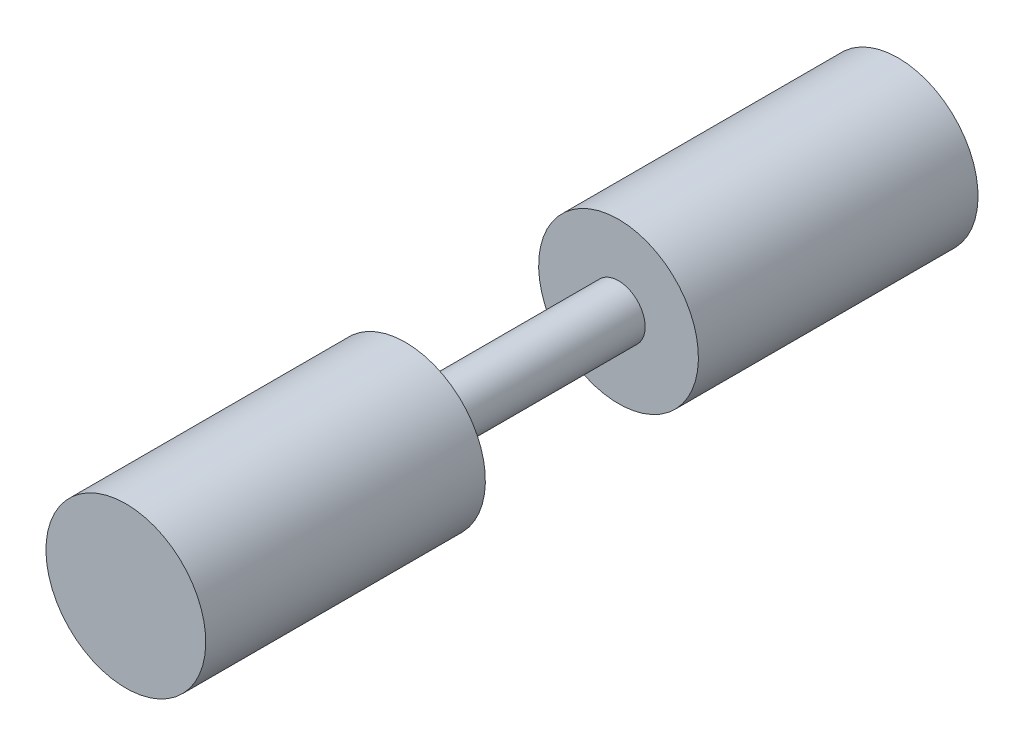
ISO-10303-21;
HEADER;
FILE_DESCRIPTION(('STEP AP214'),'2;1');
FILE_NAME('part.step','',(''),(''),'','','');
FILE_SCHEMA(('AUTOMOTIVE_DESIGN { 1 0 10303 214 1 1 1 1 }'));
ENDSEC;
DATA;
#1=APPLICATION_CONTEXT('core data for automotive mechanical design processes');
#2=APPLICATION_PROTOCOL_DEFINITION('international standard','automotive_design',2000,#1);
#3=PRODUCT_CONTEXT('',#1,'mechanical');
#4=PRODUCT('Part','Part','',(#3));
#5=PRODUCT_RELATED_PRODUCT_CATEGORY('part','',(#4));
#6=PRODUCT_DEFINITION_FORMATION('','',#4);
#7=PRODUCT_DEFINITION_CONTEXT('part definition',#1,'design');
#8=PRODUCT_DEFINITION('design','',#6,#7);
#9=PRODUCT_DEFINITION_SHAPE('','',#8);
#10=(LENGTH_UNIT() NAMED_UNIT(*) SI_UNIT(.MILLI.,.METRE.));
#11=(NAMED_UNIT(*) PLANE_ANGLE_UNIT() SI_UNIT($,.RADIAN.));
#12=(NAMED_UNIT(*) SI_UNIT($,.STERADIAN.) SOLID_ANGLE_UNIT());
#13=UNCERTAINTY_MEASURE_WITH_UNIT(LENGTH_MEASURE(1.E-05),#10,'distance_accuracy_value','');
#14=(GEOMETRIC_REPRESENTATION_CONTEXT(3) GLOBAL_UNCERTAINTY_ASSIGNED_CONTEXT((#13)) GLOBAL_UNIT_ASSIGNED_CONTEXT((#10,
#11,#12)) REPRESENTATION_CONTEXT('',''));
#15=CARTESIAN_POINT('',(0.,0.,0.));
#16=DIRECTION('',(0.,0.,1.));
#17=DIRECTION('',(1.,0.,0.));
#18=AXIS2_PLACEMENT_3D('',#15,#16,#17);
#19=CARTESIAN_POINT('',(0.,0.,-92.075));
#20=DIRECTION('',(0.,0.,-1.));
#21=DIRECTION('',(0.,1.,0.));
#22=AXIS2_PLACEMENT_3D('',#19,#20,#21);
#23=CYLINDRICAL_SURFACE('',#22,19.05);
#24=CARTESIAN_POINT('',(0.,0.,-25.4));
#25=DIRECTION('',(0.,0.,-1.));
#26=DIRECTION('',(0.,1.,0.));
#27=AXIS2_PLACEMENT_3D('',#24,#25,#26);
#28=CIRCLE('',#27,19.05);
#29=CARTESIAN_POINT('',(0.,19.05,-25.4));
#30=VERTEX_POINT('',#29);
#31=EDGE_CURVE('E52',#30,#30,#28,.T.);
#32=ORIENTED_EDGE('',*,*,#31,.T.);
#33=EDGE_LOOP('',(#32));
#34=FACE_BOUND('',#33,.T.);
#35=CARTESIAN_POINT('',(0.,0.,-92.075));
#36=DIRECTION('',(0.,0.,-1.));
#37=DIRECTION('',(0.,1.,0.));
#38=AXIS2_PLACEMENT_3D('',#35,#36,#37);
#39=CIRCLE('',#38,19.05);
#40=CARTESIAN_POINT('',(0.,19.05,-92.075));
#41=VERTEX_POINT('',#40);
#42=EDGE_CURVE('E10',#41,#41,#39,.T.);
#43=ORIENTED_EDGE('',*,*,#42,.F.);
#44=EDGE_LOOP('',(#43));
#45=FACE_BOUND('',#44,.T.);
#46=ADVANCED_FACE('F30',(#34,#45),#23,.T.);
#47=CARTESIAN_POINT('',(0.,19.05,-92.075));
#48=DIRECTION('',(0.,0.,-1.));
#49=DIRECTION('',(0.,1.,0.));
#50=AXIS2_PLACEMENT_3D('',#47,#48,#49);
#51=PLANE('',#50);
#52=ORIENTED_EDGE('',*,*,#42,.T.);
#53=EDGE_LOOP('',(#52));
#54=FACE_BOUND('',#53,.T.);
#55=ADVANCED_FACE('F70',(#54),#51,.T.);
#56=CARTESIAN_POINT('',(0.,0.,92.075));
#57=DIRECTION('',(0.,0.,1.));
#58=DIRECTION('',(0.,-1.,0.));
#59=AXIS2_PLACEMENT_3D('',#56,#57,#58);
#60=PLANE('',#59);
#61=CARTESIAN_POINT('',(0.,0.,92.075));
#62=DIRECTION('',(0.,0.,-1.));
#63=DIRECTION('',(0.,1.,0.));
#64=AXIS2_PLACEMENT_3D('',#61,#62,#63);
#65=CIRCLE('',#64,19.05);
#66=CARTESIAN_POINT('',(0.,19.05,92.075));
#67=VERTEX_POINT('',#66);
#68=EDGE_CURVE('E36',#67,#67,#65,.T.);
#69=ORIENTED_EDGE('',*,*,#68,.F.);
#70=EDGE_LOOP('',(#69));
#71=FACE_BOUND('',#70,.T.);
#72=ADVANCED_FACE('F74',(#71),#60,.T.);
#73=CARTESIAN_POINT('',(0.,0.,-92.075));
#74=DIRECTION('',(0.,0.,-1.));
#75=DIRECTION('',(0.,1.,0.));
#76=AXIS2_PLACEMENT_3D('',#73,#74,#75);
#77=CYLINDRICAL_SURFACE('',#76,19.05);
#78=ORIENTED_EDGE('',*,*,#68,.T.);
#79=EDGE_LOOP('',(#78));
#80=FACE_BOUND('',#79,.T.);
#81=CARTESIAN_POINT('',(0.,0.,25.4));
#82=DIRECTION('',(0.,0.,-1.));
#83=DIRECTION('',(0.,1.,0.));
#84=AXIS2_PLACEMENT_3D('',#81,#82,#83);
#85=CIRCLE('',#84,19.05);
#86=CARTESIAN_POINT('',(0.,19.05,25.4));
#87=VERTEX_POINT('',#86);
#88=EDGE_CURVE('E40',#87,#87,#85,.T.);
#89=ORIENTED_EDGE('',*,*,#88,.F.);
#90=EDGE_LOOP('',(#89));
#91=FACE_BOUND('',#90,.T.);
#92=ADVANCED_FACE('F78',(#80,#91),#77,.T.);
#93=CARTESIAN_POINT('',(0.,19.05,25.4));
#94=DIRECTION('',(0.,0.,-1.));
#95=DIRECTION('',(0.,1.,0.));
#96=AXIS2_PLACEMENT_3D('',#93,#94,#95);
#97=PLANE('',#96);
#98=ORIENTED_EDGE('',*,*,#88,.T.);
#99=EDGE_LOOP('',(#98));
#100=FACE_BOUND('',#99,.T.);
#101=CARTESIAN_POINT('',(0.,0.,25.4));
#102=DIRECTION('',(0.,0.,-1.));
#103=DIRECTION('',(0.,1.,0.));
#104=AXIS2_PLACEMENT_3D('',#101,#102,#103);
#105=CIRCLE('',#104,6.35);
#106=CARTESIAN_POINT('',(0.,6.34999999999998,25.4));
#107=VERTEX_POINT('',#106);
#108=EDGE_CURVE('E44',#107,#107,#105,.T.);
#109=ORIENTED_EDGE('',*,*,#108,.F.);
#110=EDGE_LOOP('',(#109));
#111=FACE_BOUND('',#110,.T.);
#112=ADVANCED_FACE('F66',(#100,#111),#97,.T.);
#113=CARTESIAN_POINT('',(0.,0.,-92.075));
#114=DIRECTION('',(0.,0.,-1.));
#115=DIRECTION('',(0.,1.,0.));
#116=AXIS2_PLACEMENT_3D('',#113,#114,#115);
#117=CYLINDRICAL_SURFACE('',#116,6.35);
#118=ORIENTED_EDGE('',*,*,#108,.T.);
#119=EDGE_LOOP('',(#118));
#120=FACE_BOUND('',#119,.T.);
#121=CARTESIAN_POINT('',(0.,0.,-25.4));
#122=DIRECTION('',(0.,0.,-1.));
#123=DIRECTION('',(0.,1.,0.));
#124=AXIS2_PLACEMENT_3D('',#121,#122,#123);
#125=CIRCLE('',#124,6.35);
#126=CARTESIAN_POINT('',(0.,6.34999999999998,-25.4));
#127=VERTEX_POINT('',#126);
#128=EDGE_CURVE('E49',#127,#127,#125,.T.);
#129=ORIENTED_EDGE('',*,*,#128,.F.);
#130=EDGE_LOOP('',(#129));
#131=FACE_BOUND('',#130,.T.);
#132=ADVANCED_FACE('F60',(#120,#131),#117,.T.);
#133=CARTESIAN_POINT('',(0.,6.34999999999998,-25.4));
#134=DIRECTION('',(0.,0.,1.));
#135=DIRECTION('',(0.,-1.,0.));
#136=AXIS2_PLACEMENT_3D('',#133,#134,#135);
#137=PLANE('',#136);
#138=ORIENTED_EDGE('',*,*,#128,.T.);
#139=EDGE_LOOP('',(#138));
#140=FACE_BOUND('',#139,.T.);
#141=ORIENTED_EDGE('',*,*,#31,.F.);
#142=EDGE_LOOP('',(#141));
#143=FACE_BOUND('',#142,.T.);
#144=ADVANCED_FACE('F58',(#140,#143),#137,.T.);
#145=CLOSED_SHELL('',(#46,#55,#72,#92,#112,#132,#144));
#146=MANIFOLD_SOLID_BREP('B2',#145);
#147=ADVANCED_BREP_SHAPE_REPRESENTATION('',(#18,#146),#14);
#148=SHAPE_DEFINITION_REPRESENTATION(#9,#147);
ENDSEC;
END-ISO-10303-21;
